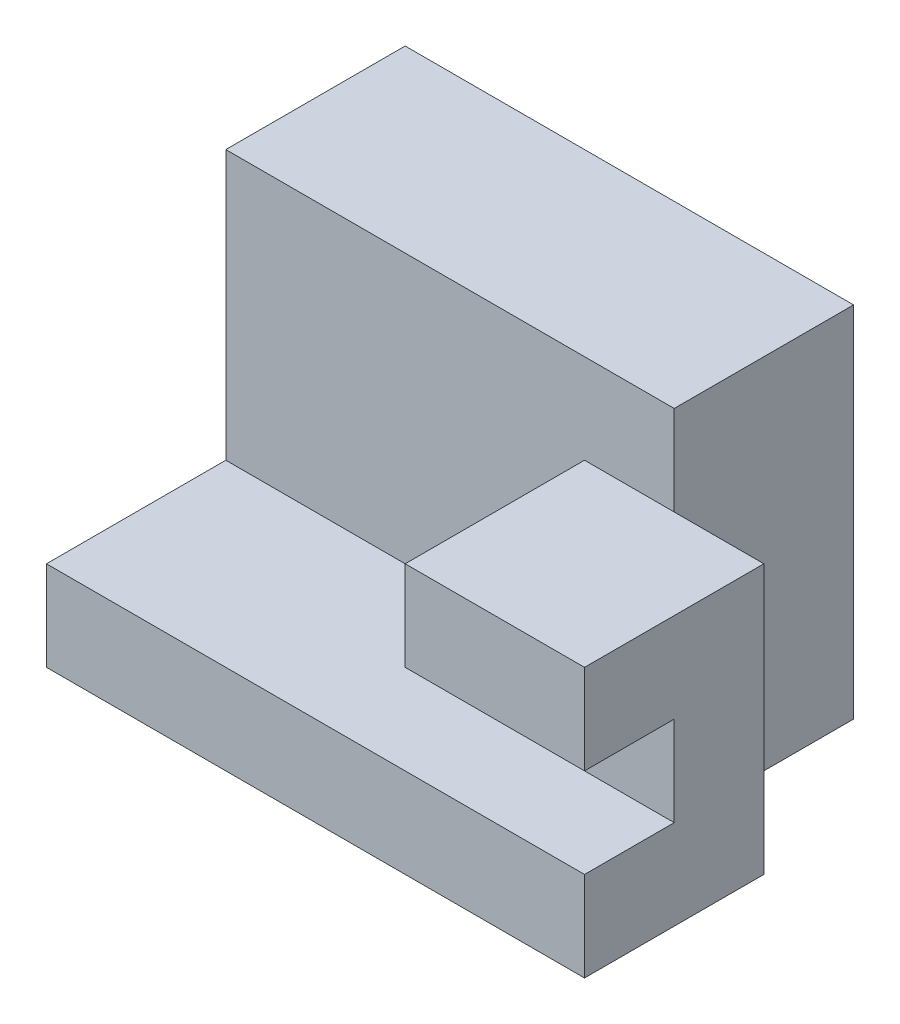
ISO-10303-21;
HEADER;
FILE_DESCRIPTION(('STEP AP214'),'2;1');
FILE_NAME('part.step','',(''),(''),'','','');
FILE_SCHEMA(('AUTOMOTIVE_DESIGN { 1 0 10303 214 1 1 1 1 }'));
ENDSEC;
DATA;
#1=APPLICATION_CONTEXT('core data for automotive mechanical design processes');
#2=APPLICATION_PROTOCOL_DEFINITION('international standard','automotive_design',2000,#1);
#3=PRODUCT_CONTEXT('',#1,'mechanical');
#4=PRODUCT('Part','Part','',(#3));
#5=PRODUCT_RELATED_PRODUCT_CATEGORY('part','',(#4));
#6=PRODUCT_DEFINITION_FORMATION('','',#4);
#7=PRODUCT_DEFINITION_CONTEXT('part definition',#1,'design');
#8=PRODUCT_DEFINITION('design','',#6,#7);
#9=PRODUCT_DEFINITION_SHAPE('','',#8);
#10=(LENGTH_UNIT() NAMED_UNIT(*) SI_UNIT(.MILLI.,.METRE.));
#11=(NAMED_UNIT(*) PLANE_ANGLE_UNIT() SI_UNIT($,.RADIAN.));
#12=(NAMED_UNIT(*) SI_UNIT($,.STERADIAN.) SOLID_ANGLE_UNIT());
#13=UNCERTAINTY_MEASURE_WITH_UNIT(LENGTH_MEASURE(1.E-05),#10,'distance_accuracy_value','');
#14=(GEOMETRIC_REPRESENTATION_CONTEXT(3) GLOBAL_UNCERTAINTY_ASSIGNED_CONTEXT((#13)) GLOBAL_UNIT_ASSIGNED_CONTEXT((#10,
#11,#12)) REPRESENTATION_CONTEXT('',''));
#15=CARTESIAN_POINT('',(0.,0.,0.));
#16=DIRECTION('',(0.,0.,1.));
#17=DIRECTION('',(1.,0.,0.));
#18=AXIS2_PLACEMENT_3D('',#15,#16,#17);
#19=CARTESIAN_POINT('',(0.,254.,0.));
#20=DIRECTION('',(0.,0.,1.));
#21=DIRECTION('',(1.,0.,0.));
#22=AXIS2_PLACEMENT_3D('',#19,#20,#21);
#23=PLANE('',#22);
#24=DIRECTION('',(0.,-1.,0.));
#25=VECTOR('',#24,1.);
#26=CARTESIAN_POINT('',(1524.,762.,0.));
#27=LINE('',#26,#25);
#28=CARTESIAN_POINT('',(1524.,254.,0.));
#29=VERTEX_POINT('',#28);
#30=CARTESIAN_POINT('',(1524.,0.,0.));
#31=VERTEX_POINT('',#30);
#32=EDGE_CURVE('E150',#29,#31,#27,.T.);
#33=ORIENTED_EDGE('',*,*,#32,.F.);
#34=DIRECTION('',(-1.,0.,0.));
#35=VECTOR('',#34,1.);
#36=CARTESIAN_POINT('',(0.,254.,0.));
#37=LINE('',#36,#35);
#38=CARTESIAN_POINT('',(0.,254.,0.));
#39=VERTEX_POINT('',#38);
#40=EDGE_CURVE('E140',#29,#39,#37,.T.);
#41=ORIENTED_EDGE('',*,*,#40,.T.);
#42=DIRECTION('',(0.,-1.,0.));
#43=VECTOR('',#42,1.);
#44=CARTESIAN_POINT('',(0.,254.,0.));
#45=LINE('',#44,#43);
#46=CARTESIAN_POINT('',(0.,0.,0.));
#47=VERTEX_POINT('',#46);
#48=EDGE_CURVE('E11',#39,#47,#45,.T.);
#49=ORIENTED_EDGE('',*,*,#48,.T.);
#50=DIRECTION('',(-1.,0.,0.));
#51=VECTOR('',#50,1.);
#52=CARTESIAN_POINT('',(0.,0.,0.));
#53=LINE('',#52,#51);
#54=EDGE_CURVE('E155',#31,#47,#53,.T.);
#55=ORIENTED_EDGE('',*,*,#54,.F.);
#56=EDGE_LOOP('',(#33,#41,#49,#55));
#57=FACE_BOUND('',#56,.T.);
#58=ADVANCED_FACE('F33',(#57),#23,.T.);
#59=DIRECTION('',(-1.,0.,0.));
#60=VECTOR('',#59,1.);
#61=CARTESIAN_POINT('',(1524.,508.,0.));
#62=LINE('',#61,#60);
#63=CARTESIAN_POINT('',(1524.,508.,0.));
#64=VERTEX_POINT('',#63);
#65=CARTESIAN_POINT('',(1016.,508.,0.));
#66=VERTEX_POINT('',#65);
#67=EDGE_CURVE('E233',#64,#66,#62,.T.);
#68=ORIENTED_EDGE('',*,*,#67,.F.);
#69=CARTESIAN_POINT('',(1524.,762.,0.));
#70=VERTEX_POINT('',#69);
#71=EDGE_CURVE('E157',#70,#64,#27,.T.);
#72=ORIENTED_EDGE('',*,*,#71,.F.);
#73=DIRECTION('',(-1.,0.,0.));
#74=VECTOR('',#73,1.);
#75=CARTESIAN_POINT('',(0.,762.,1.92629626659872E-13));
#76=LINE('',#75,#74);
#77=CARTESIAN_POINT('',(1016.,762.,0.));
#78=VERTEX_POINT('',#77);
#79=EDGE_CURVE('E230',#70,#78,#76,.T.);
#80=ORIENTED_EDGE('',*,*,#79,.T.);
#81=DIRECTION('',(0.,-1.,0.));
#82=VECTOR('',#81,1.);
#83=CARTESIAN_POINT('',(1016.,762.,0.));
#84=LINE('',#83,#82);
#85=EDGE_CURVE('E161',#78,#66,#84,.T.);
#86=ORIENTED_EDGE('',*,*,#85,.T.);
#87=EDGE_LOOP('',(#68,#72,#80,#86));
#88=FACE_BOUND('',#87,.T.);
#89=ADVANCED_FACE('F35',(#88),#23,.T.);
#90=CARTESIAN_POINT('',(0.,254.,0.));
#91=DIRECTION('',(-1.,0.,0.));
#92=DIRECTION('',(0.,0.,1.));
#93=AXIS2_PLACEMENT_3D('',#90,#91,#92);
#94=PLANE('',#93);
#95=DIRECTION('',(0.,0.,-1.));
#96=VECTOR('',#95,1.);
#97=CARTESIAN_POINT('',(0.,0.,0.));
#98=LINE('',#97,#96);
#99=CARTESIAN_POINT('',(0.,0.,-1016.));
#100=VERTEX_POINT('',#99);
#101=EDGE_CURVE('E88',#47,#100,#98,.T.);
#102=ORIENTED_EDGE('',*,*,#101,.F.);
#103=ORIENTED_EDGE('',*,*,#48,.F.);
#104=DIRECTION('',(0.,0.,-1.));
#105=VECTOR('',#104,1.);
#106=CARTESIAN_POINT('',(0.,254.,0.));
#107=LINE('',#106,#105);
#108=CARTESIAN_POINT('',(0.,254.,-508.));
#109=VERTEX_POINT('',#108);
#110=EDGE_CURVE('E41',#39,#109,#107,.T.);
#111=ORIENTED_EDGE('',*,*,#110,.T.);
#112=DIRECTION('',(0.,-1.,0.));
#113=VECTOR('',#112,1.);
#114=CARTESIAN_POINT('',(0.,1016.,-508.));
#115=LINE('',#114,#113);
#116=CARTESIAN_POINT('',(0.,1016.,-508.));
#117=VERTEX_POINT('',#116);
#118=EDGE_CURVE('E70',#117,#109,#115,.T.);
#119=ORIENTED_EDGE('',*,*,#118,.F.);
#120=DIRECTION('',(0.,0.,-1.));
#121=VECTOR('',#120,1.);
#122=CARTESIAN_POINT('',(0.,1016.,0.));
#123=LINE('',#122,#121);
#124=CARTESIAN_POINT('',(0.,1016.,-1016.));
#125=VERTEX_POINT('',#124);
#126=EDGE_CURVE('E182',#117,#125,#123,.T.);
#127=ORIENTED_EDGE('',*,*,#126,.T.);
#128=DIRECTION('',(0.,-1.,0.));
#129=VECTOR('',#128,1.);
#130=CARTESIAN_POINT('',(0.,1016.,-1016.));
#131=LINE('',#130,#129);
#132=EDGE_CURVE('E188',#125,#100,#131,.T.);
#133=ORIENTED_EDGE('',*,*,#132,.T.);
#134=EDGE_LOOP('',(#102,#103,#111,#119,#127,#133));
#135=FACE_BOUND('',#134,.T.);
#136=ADVANCED_FACE('F200',(#135),#94,.T.);
#137=CARTESIAN_POINT('',(0.,254.,0.));
#138=DIRECTION('',(0.,1.,0.));
#139=DIRECTION('',(0.,0.,1.));
#140=AXIS2_PLACEMENT_3D('',#137,#138,#139);
#141=PLANE('',#140);
#142=ORIENTED_EDGE('',*,*,#40,.F.);
#143=DIRECTION('',(0.,0.,1.));
#144=VECTOR('',#143,1.);
#145=CARTESIAN_POINT('',(1524.,254.,-254.));
#146=LINE('',#145,#144);
#147=CARTESIAN_POINT('',(1524.,254.,-254.));
#148=VERTEX_POINT('',#147);
#149=EDGE_CURVE('E143',#148,#29,#146,.T.);
#150=ORIENTED_EDGE('',*,*,#149,.F.);
#151=DIRECTION('',(-1.,0.,0.));
#152=VECTOR('',#151,1.);
#153=CARTESIAN_POINT('',(1524.,254.,-254.));
#154=LINE('',#153,#152);
#155=CARTESIAN_POINT('',(1016.,254.,-254.));
#156=VERTEX_POINT('',#155);
#157=EDGE_CURVE('E239',#148,#156,#154,.T.);
#158=ORIENTED_EDGE('',*,*,#157,.T.);
#159=DIRECTION('',(0.,0.,-1.));
#160=VECTOR('',#159,1.);
#161=CARTESIAN_POINT('',(1016.,254.,0.));
#162=LINE('',#161,#160);
#163=CARTESIAN_POINT('',(1016.,254.,-508.));
#164=VERTEX_POINT('',#163);
#165=EDGE_CURVE('E145',#156,#164,#162,.T.);
#166=ORIENTED_EDGE('',*,*,#165,.T.);
#167=DIRECTION('',(-1.,0.,0.));
#168=VECTOR('',#167,1.);
#169=CARTESIAN_POINT('',(0.,254.,-508.));
#170=LINE('',#169,#168);
#171=EDGE_CURVE('E195',#164,#109,#170,.T.);
#172=ORIENTED_EDGE('',*,*,#171,.T.);
#173=ORIENTED_EDGE('',*,*,#110,.F.);
#174=EDGE_LOOP('',(#142,#150,#158,#166,#172,#173));
#175=FACE_BOUND('',#174,.T.);
#176=ADVANCED_FACE('F142',(#175),#141,.T.);
#177=CARTESIAN_POINT('',(0.,0.,0.));
#178=DIRECTION('',(0.,1.,0.));
#179=DIRECTION('',(0.,0.,1.));
#180=AXIS2_PLACEMENT_3D('',#177,#178,#179);
#181=PLANE('',#180);
#182=ORIENTED_EDGE('',*,*,#54,.T.);
#183=ORIENTED_EDGE('',*,*,#101,.T.);
#184=DIRECTION('',(1.,0.,0.));
#185=VECTOR('',#184,1.);
#186=CARTESIAN_POINT('',(0.,0.,-1016.));
#187=LINE('',#186,#185);
#188=CARTESIAN_POINT('',(1270.,0.,-1016.));
#189=VERTEX_POINT('',#188);
#190=EDGE_CURVE('E176',#100,#189,#187,.T.);
#191=ORIENTED_EDGE('',*,*,#190,.T.);
#192=DIRECTION('',(0.,0.,1.));
#193=VECTOR('',#192,1.);
#194=CARTESIAN_POINT('',(1270.,0.,0.));
#195=LINE('',#194,#193);
#196=CARTESIAN_POINT('',(1270.,0.,-508.));
#197=VERTEX_POINT('',#196);
#198=EDGE_CURVE('E172',#189,#197,#195,.T.);
#199=ORIENTED_EDGE('',*,*,#198,.T.);
#200=DIRECTION('',(1.,0.,0.));
#201=VECTOR('',#200,1.);
#202=CARTESIAN_POINT('',(0.,0.,-508.));
#203=LINE('',#202,#201);
#204=CARTESIAN_POINT('',(1524.,0.,-508.));
#205=VERTEX_POINT('',#204);
#206=EDGE_CURVE('E207',#197,#205,#203,.T.);
#207=ORIENTED_EDGE('',*,*,#206,.T.);
#208=DIRECTION('',(0.,0.,1.));
#209=VECTOR('',#208,1.);
#210=CARTESIAN_POINT('',(1524.,0.,0.));
#211=LINE('',#210,#209);
#212=EDGE_CURVE('E199',#205,#31,#211,.T.);
#213=ORIENTED_EDGE('',*,*,#212,.T.);
#214=EDGE_LOOP('',(#182,#183,#191,#199,#207,#213));
#215=FACE_BOUND('',#214,.T.);
#216=ADVANCED_FACE('F198',(#215),#181,.F.);
#217=CARTESIAN_POINT('',(0.,1016.,-508.));
#218=DIRECTION('',(0.,0.,1.));
#219=DIRECTION('',(1.,0.,0.));
#220=AXIS2_PLACEMENT_3D('',#217,#218,#219);
#221=PLANE('',#220);
#222=DIRECTION('',(0.,-1.,0.));
#223=VECTOR('',#222,1.);
#224=CARTESIAN_POINT('',(1016.,762.,-508.));
#225=LINE('',#224,#223);
#226=CARTESIAN_POINT('',(1016.,762.,-508.));
#227=VERTEX_POINT('',#226);
#228=EDGE_CURVE('E169',#227,#164,#225,.T.);
#229=ORIENTED_EDGE('',*,*,#228,.F.);
#230=DIRECTION('',(1.,0.,0.));
#231=VECTOR('',#230,1.);
#232=CARTESIAN_POINT('',(0.,762.,-508.));
#233=LINE('',#232,#231);
#234=CARTESIAN_POINT('',(1270.,762.,-508.));
#235=VERTEX_POINT('',#234);
#236=EDGE_CURVE('E221',#227,#235,#233,.T.);
#237=ORIENTED_EDGE('',*,*,#236,.T.);
#238=DIRECTION('',(0.,-1.,0.));
#239=VECTOR('',#238,1.);
#240=CARTESIAN_POINT('',(1270.,1016.,-508.));
#241=LINE('',#240,#239);
#242=CARTESIAN_POINT('',(1270.,1016.,-508.));
#243=VERTEX_POINT('',#242);
#244=EDGE_CURVE('E95',#243,#235,#241,.T.);
#245=ORIENTED_EDGE('',*,*,#244,.F.);
#246=DIRECTION('',(-1.,0.,0.));
#247=VECTOR('',#246,1.);
#248=CARTESIAN_POINT('',(0.,1016.,-508.));
#249=LINE('',#248,#247);
#250=EDGE_CURVE('E173',#243,#117,#249,.T.);
#251=ORIENTED_EDGE('',*,*,#250,.T.);
#252=ORIENTED_EDGE('',*,*,#118,.T.);
#253=ORIENTED_EDGE('',*,*,#171,.F.);
#254=EDGE_LOOP('',(#229,#237,#245,#251,#252,#253));
#255=FACE_BOUND('',#254,.T.);
#256=ADVANCED_FACE('F227',(#255),#221,.T.);
#257=CARTESIAN_POINT('',(1270.,1016.,0.));
#258=DIRECTION('',(1.,0.,0.));
#259=DIRECTION('',(0.,0.,-1.));
#260=AXIS2_PLACEMENT_3D('',#257,#258,#259);
#261=PLANE('',#260);
#262=ORIENTED_EDGE('',*,*,#198,.F.);
#263=DIRECTION('',(0.,-1.,0.));
#264=VECTOR('',#263,1.);
#265=CARTESIAN_POINT('',(1270.,1016.,-1016.));
#266=LINE('',#265,#264);
#267=CARTESIAN_POINT('',(1270.,1016.,-1016.));
#268=VERTEX_POINT('',#267);
#269=EDGE_CURVE('E190',#268,#189,#266,.T.);
#270=ORIENTED_EDGE('',*,*,#269,.F.);
#271=DIRECTION('',(0.,0.,1.));
#272=VECTOR('',#271,1.);
#273=CARTESIAN_POINT('',(1270.,1016.,0.));
#274=LINE('',#273,#272);
#275=EDGE_CURVE('E175',#268,#243,#274,.T.);
#276=ORIENTED_EDGE('',*,*,#275,.T.);
#277=ORIENTED_EDGE('',*,*,#244,.T.);
#278=EDGE_CURVE('E192',#235,#197,#241,.T.);
#279=ORIENTED_EDGE('',*,*,#278,.T.);
#280=EDGE_LOOP('',(#262,#270,#276,#277,#279));
#281=FACE_BOUND('',#280,.T.);
#282=ADVANCED_FACE('F210',(#281),#261,.T.);
#283=CARTESIAN_POINT('',(0.,1016.,-1016.));
#284=DIRECTION('',(0.,0.,-1.));
#285=DIRECTION('',(-1.,0.,0.));
#286=AXIS2_PLACEMENT_3D('',#283,#284,#285);
#287=PLANE('',#286);
#288=ORIENTED_EDGE('',*,*,#190,.F.);
#289=ORIENTED_EDGE('',*,*,#132,.F.);
#290=DIRECTION('',(1.,0.,0.));
#291=VECTOR('',#290,1.);
#292=CARTESIAN_POINT('',(0.,1016.,-1016.));
#293=LINE('',#292,#291);
#294=EDGE_CURVE('E179',#125,#268,#293,.T.);
#295=ORIENTED_EDGE('',*,*,#294,.T.);
#296=ORIENTED_EDGE('',*,*,#269,.T.);
#297=EDGE_LOOP('',(#288,#289,#295,#296));
#298=FACE_BOUND('',#297,.T.);
#299=ADVANCED_FACE('F205',(#298),#287,.T.);
#300=CARTESIAN_POINT('',(0.,1016.,0.));
#301=DIRECTION('',(0.,1.,0.));
#302=DIRECTION('',(0.,0.,1.));
#303=AXIS2_PLACEMENT_3D('',#300,#301,#302);
#304=PLANE('',#303);
#305=ORIENTED_EDGE('',*,*,#250,.F.);
#306=ORIENTED_EDGE('',*,*,#275,.F.);
#307=ORIENTED_EDGE('',*,*,#294,.F.);
#308=ORIENTED_EDGE('',*,*,#126,.F.);
#309=EDGE_LOOP('',(#305,#306,#307,#308));
#310=FACE_BOUND('',#309,.T.);
#311=ADVANCED_FACE('F287',(#310),#304,.T.);
#312=CARTESIAN_POINT('',(0.,762.,-508.));
#313=DIRECTION('',(0.,0.,-1.));
#314=DIRECTION('',(-1.,0.,0.));
#315=AXIS2_PLACEMENT_3D('',#312,#313,#314);
#316=PLANE('',#315);
#317=ORIENTED_EDGE('',*,*,#206,.F.);
#318=ORIENTED_EDGE('',*,*,#278,.F.);
#319=CARTESIAN_POINT('',(1524.,762.,-508.));
#320=VERTEX_POINT('',#319);
#321=EDGE_CURVE('E215',#235,#320,#233,.T.);
#322=ORIENTED_EDGE('',*,*,#321,.T.);
#323=DIRECTION('',(0.,-1.,0.));
#324=VECTOR('',#323,1.);
#325=CARTESIAN_POINT('',(1524.,762.,-508.));
#326=LINE('',#325,#324);
#327=EDGE_CURVE('E158',#320,#205,#326,.T.);
#328=ORIENTED_EDGE('',*,*,#327,.T.);
#329=EDGE_LOOP('',(#317,#318,#322,#328));
#330=FACE_BOUND('',#329,.T.);
#331=ADVANCED_FACE('F214',(#330),#316,.T.);
#332=CARTESIAN_POINT('',(1016.,762.,0.));
#333=DIRECTION('',(-1.,0.,0.));
#334=DIRECTION('',(0.,0.,1.));
#335=AXIS2_PLACEMENT_3D('',#332,#333,#334);
#336=PLANE('',#335);
#337=DIRECTION('',(0.,-1.,0.));
#338=VECTOR('',#337,1.);
#339=CARTESIAN_POINT('',(1016.,254.,-254.));
#340=LINE('',#339,#338);
#341=CARTESIAN_POINT('',(1016.,508.,-254.));
#342=VERTEX_POINT('',#341);
#343=EDGE_CURVE('E153',#342,#156,#340,.T.);
#344=ORIENTED_EDGE('',*,*,#343,.F.);
#345=DIRECTION('',(0.,0.,-1.));
#346=VECTOR('',#345,1.);
#347=CARTESIAN_POINT('',(1016.,508.,-254.));
#348=LINE('',#347,#346);
#349=EDGE_CURVE('E245',#66,#342,#348,.T.);
#350=ORIENTED_EDGE('',*,*,#349,.F.);
#351=ORIENTED_EDGE('',*,*,#85,.F.);
#352=DIRECTION('',(0.,0.,-1.));
#353=VECTOR('',#352,1.);
#354=CARTESIAN_POINT('',(1016.,762.,0.));
#355=LINE('',#354,#353);
#356=EDGE_CURVE('E229',#78,#227,#355,.T.);
#357=ORIENTED_EDGE('',*,*,#356,.T.);
#358=ORIENTED_EDGE('',*,*,#228,.T.);
#359=ORIENTED_EDGE('',*,*,#165,.F.);
#360=EDGE_LOOP('',(#344,#350,#351,#357,#358,#359));
#361=FACE_BOUND('',#360,.T.);
#362=ADVANCED_FACE('F256',(#361),#336,.T.);
#363=CARTESIAN_POINT('',(1524.,762.,0.));
#364=DIRECTION('',(1.,0.,0.));
#365=DIRECTION('',(0.,0.,-1.));
#366=AXIS2_PLACEMENT_3D('',#363,#364,#365);
#367=PLANE('',#366);
#368=ORIENTED_EDGE('',*,*,#149,.T.);
#369=ORIENTED_EDGE('',*,*,#32,.T.);
#370=ORIENTED_EDGE('',*,*,#212,.F.);
#371=ORIENTED_EDGE('',*,*,#327,.F.);
#372=DIRECTION('',(0.,0.,1.));
#373=VECTOR('',#372,1.);
#374=CARTESIAN_POINT('',(1524.,762.,0.));
#375=LINE('',#374,#373);
#376=EDGE_CURVE('E163',#320,#70,#375,.T.);
#377=ORIENTED_EDGE('',*,*,#376,.T.);
#378=ORIENTED_EDGE('',*,*,#71,.T.);
#379=DIRECTION('',(0.,0.,-1.));
#380=VECTOR('',#379,1.);
#381=CARTESIAN_POINT('',(1524.,508.,-254.));
#382=LINE('',#381,#380);
#383=CARTESIAN_POINT('',(1524.,508.,-254.));
#384=VERTEX_POINT('',#383);
#385=EDGE_CURVE('E152',#64,#384,#382,.T.);
#386=ORIENTED_EDGE('',*,*,#385,.T.);
#387=DIRECTION('',(0.,-1.,0.));
#388=VECTOR('',#387,1.);
#389=CARTESIAN_POINT('',(1524.,254.,-254.));
#390=LINE('',#389,#388);
#391=EDGE_CURVE('E48',#384,#148,#390,.T.);
#392=ORIENTED_EDGE('',*,*,#391,.T.);
#393=EDGE_LOOP('',(#368,#369,#370,#371,#377,#378,#386,#392));
#394=FACE_BOUND('',#393,.T.);
#395=ADVANCED_FACE('F148',(#394),#367,.T.);
#396=CARTESIAN_POINT('',(0.,762.,0.));
#397=DIRECTION('',(0.,1.,0.));
#398=DIRECTION('',(0.,0.,1.));
#399=AXIS2_PLACEMENT_3D('',#396,#397,#398);
#400=PLANE('',#399);
#401=ORIENTED_EDGE('',*,*,#236,.F.);
#402=ORIENTED_EDGE('',*,*,#356,.F.);
#403=ORIENTED_EDGE('',*,*,#79,.F.);
#404=ORIENTED_EDGE('',*,*,#376,.F.);
#405=ORIENTED_EDGE('',*,*,#321,.F.);
#406=EDGE_LOOP('',(#401,#402,#403,#404,#405));
#407=FACE_BOUND('',#406,.T.);
#408=ADVANCED_FACE('F219',(#407),#400,.T.);
#409=CARTESIAN_POINT('',(1524.,254.,-254.));
#410=DIRECTION('',(0.,0.,-1.));
#411=DIRECTION('',(0.,1.,0.));
#412=AXIS2_PLACEMENT_3D('',#409,#410,#411);
#413=PLANE('',#412);
#414=ORIENTED_EDGE('',*,*,#343,.T.);
#415=ORIENTED_EDGE('',*,*,#157,.F.);
#416=ORIENTED_EDGE('',*,*,#391,.F.);
#417=DIRECTION('',(-1.,0.,0.));
#418=VECTOR('',#417,1.);
#419=CARTESIAN_POINT('',(1524.,508.,-254.));
#420=LINE('',#419,#418);
#421=EDGE_CURVE('E240',#384,#342,#420,.T.);
#422=ORIENTED_EDGE('',*,*,#421,.T.);
#423=EDGE_LOOP('',(#414,#415,#416,#422));
#424=FACE_BOUND('',#423,.T.);
#425=ADVANCED_FACE('F258',(#424),#413,.F.);
#426=CARTESIAN_POINT('',(1524.,508.,-254.));
#427=DIRECTION('',(0.,1.,0.));
#428=DIRECTION('',(0.,0.,1.));
#429=AXIS2_PLACEMENT_3D('',#426,#427,#428);
#430=PLANE('',#429);
#431=ORIENTED_EDGE('',*,*,#349,.T.);
#432=ORIENTED_EDGE('',*,*,#421,.F.);
#433=ORIENTED_EDGE('',*,*,#385,.F.);
#434=ORIENTED_EDGE('',*,*,#67,.T.);
#435=EDGE_LOOP('',(#431,#432,#433,#434));
#436=FACE_BOUND('',#435,.T.);
#437=ADVANCED_FACE('F251',(#436),#430,.F.);
#438=CLOSED_SHELL('',(#58,#89,#136,#176,#216,#256,#282,#299,#311,#331,#362,#395,#408,#425,#437));
#439=MANIFOLD_SOLID_BREP('B2',#438);
#440=ADVANCED_BREP_SHAPE_REPRESENTATION('',(#18,#439),#14);
#441=SHAPE_DEFINITION_REPRESENTATION(#9,#440);
ENDSEC;
END-ISO-10303-21;
